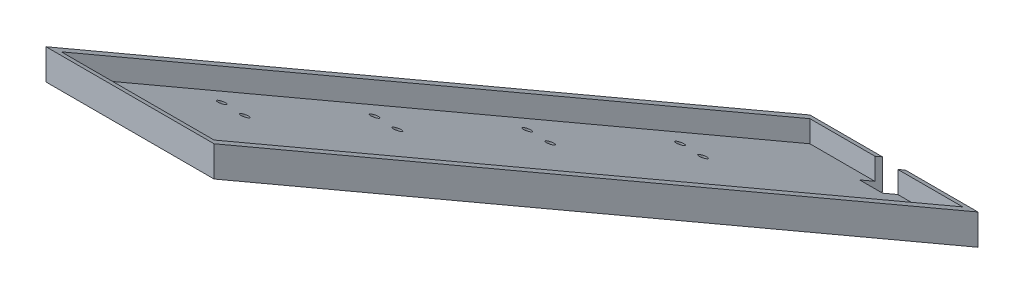
ISO-10303-21;
HEADER;
FILE_DESCRIPTION(('STEP AP214'),'2;1');
FILE_NAME('part.step','',(''),(''),'','','');
FILE_SCHEMA(('AUTOMOTIVE_DESIGN { 1 0 10303 214 1 1 1 1 }'));
ENDSEC;
DATA;
#1=APPLICATION_CONTEXT('core data for automotive mechanical design processes');
#2=APPLICATION_PROTOCOL_DEFINITION('international standard','automotive_design',2000,#1);
#3=PRODUCT_CONTEXT('',#1,'mechanical');
#4=PRODUCT('Part','Part','',(#3));
#5=PRODUCT_RELATED_PRODUCT_CATEGORY('part','',(#4));
#6=PRODUCT_DEFINITION_FORMATION('','',#4);
#7=PRODUCT_DEFINITION_CONTEXT('part definition',#1,'design');
#8=PRODUCT_DEFINITION('design','',#6,#7);
#9=PRODUCT_DEFINITION_SHAPE('','',#8);
#10=(LENGTH_UNIT() NAMED_UNIT(*) SI_UNIT(.MILLI.,.METRE.));
#11=(NAMED_UNIT(*) PLANE_ANGLE_UNIT() SI_UNIT($,.RADIAN.));
#12=(NAMED_UNIT(*) SI_UNIT($,.STERADIAN.) SOLID_ANGLE_UNIT());
#13=UNCERTAINTY_MEASURE_WITH_UNIT(LENGTH_MEASURE(1.E-05),#10,'distance_accuracy_value','');
#14=(GEOMETRIC_REPRESENTATION_CONTEXT(3) GLOBAL_UNCERTAINTY_ASSIGNED_CONTEXT((#13)) GLOBAL_UNIT_ASSIGNED_CONTEXT((#10,
#11,#12)) REPRESENTATION_CONTEXT('',''));
#15=CARTESIAN_POINT('',(0.,0.,0.));
#16=DIRECTION('',(0.,0.,1.));
#17=DIRECTION('',(1.,0.,0.));
#18=AXIS2_PLACEMENT_3D('',#15,#16,#17);
#19=CARTESIAN_POINT('',(110.,20.,0.));
#20=DIRECTION('',(0.,-0.866025403784442,0.499999999999994));
#21=DIRECTION('',(0.,-0.499999999999994,-0.866025403784442));
#22=AXIS2_PLACEMENT_3D('',#19,#20,#21);
#23=PLANE('',#22);
#24=DIRECTION('',(0.,-0.499999999999994,-0.866025403784442));
#25=VECTOR('',#24,1.);
#26=CARTESIAN_POINT('',(62.5,20.,0.));
#27=LINE('',#26,#25);
#28=CARTESIAN_POINT('',(62.5,22.8867513459483,4.99999999999995));
#29=VERTEX_POINT('',#28);
#30=CARTESIAN_POINT('',(62.5,20.,0.));
#31=VERTEX_POINT('',#30);
#32=EDGE_CURVE('E271',#29,#31,#27,.T.);
#33=ORIENTED_EDGE('',*,*,#32,.F.);
#34=DIRECTION('',(-1.,0.,0.));
#35=VECTOR('',#34,1.);
#36=CARTESIAN_POINT('',(105.,22.8867513459483,4.99999999999995));
#37=LINE('',#36,#35);
#38=CARTESIAN_POINT('',(105.,22.8867513459483,4.99999999999995));
#39=VERTEX_POINT('',#38);
#40=EDGE_CURVE('E302',#39,#29,#37,.T.);
#41=ORIENTED_EDGE('',*,*,#40,.F.);
#42=DIRECTION('',(0.,0.5,0.866025403784439));
#43=VECTOR('',#42,1.);
#44=CARTESIAN_POINT('',(105.,305.788383248865,495.));
#45=LINE('',#44,#43);
#46=CARTESIAN_POINT('',(105.,305.788383248865,495.));
#47=VERTEX_POINT('',#46);
#48=EDGE_CURVE('E288',#39,#47,#45,.T.);
#49=ORIENTED_EDGE('',*,*,#48,.T.);
#50=DIRECTION('',(-1.,0.,0.));
#51=VECTOR('',#50,1.);
#52=CARTESIAN_POINT('',(105.,305.788383248865,495.));
#53=LINE('',#52,#51);
#54=CARTESIAN_POINT('',(5.,305.788383248865,495.));
#55=VERTEX_POINT('',#54);
#56=EDGE_CURVE('E291',#47,#55,#53,.T.);
#57=ORIENTED_EDGE('',*,*,#56,.T.);
#58=DIRECTION('',(0.,0.5,0.866025403784439));
#59=VECTOR('',#58,1.);
#60=CARTESIAN_POINT('',(5.,305.788383248865,495.));
#61=LINE('',#60,#59);
#62=CARTESIAN_POINT('',(5.,22.8867513459481,4.99999999999995));
#63=VERTEX_POINT('',#62);
#64=EDGE_CURVE('E284',#63,#55,#61,.T.);
#65=ORIENTED_EDGE('',*,*,#64,.F.);
#66=CARTESIAN_POINT('',(47.5,22.8867513459483,4.99999999999995));
#67=VERTEX_POINT('',#66);
#68=EDGE_CURVE('E64',#67,#63,#37,.T.);
#69=ORIENTED_EDGE('',*,*,#68,.F.);
#70=DIRECTION('',(0.,0.499999999999994,0.866025403784442));
#71=VECTOR('',#70,1.);
#72=CARTESIAN_POINT('',(47.5,20.,0.));
#73=LINE('',#72,#71);
#74=CARTESIAN_POINT('',(47.5,20.,0.));
#75=VERTEX_POINT('',#74);
#76=EDGE_CURVE('E57',#75,#67,#73,.T.);
#77=ORIENTED_EDGE('',*,*,#76,.F.);
#78=DIRECTION('',(-1.,0.,0.));
#79=VECTOR('',#78,1.);
#80=CARTESIAN_POINT('',(110.,20.,0.));
#81=LINE('',#80,#79);
#82=CARTESIAN_POINT('',(0.,20.,0.));
#83=VERTEX_POINT('',#82);
#84=EDGE_CURVE('E160',#75,#83,#81,.T.);
#85=ORIENTED_EDGE('',*,*,#84,.T.);
#86=DIRECTION('',(0.,0.499999999999994,0.866025403784442));
#87=VECTOR('',#86,1.);
#88=CARTESIAN_POINT('',(0.,20.,0.));
#89=LINE('',#88,#87);
#90=CARTESIAN_POINT('',(0.,308.675134594809,500.));
#91=VERTEX_POINT('',#90);
#92=EDGE_CURVE('E320',#83,#91,#89,.T.);
#93=ORIENTED_EDGE('',*,*,#92,.T.);
#94=DIRECTION('',(-1.,0.,0.));
#95=VECTOR('',#94,1.);
#96=CARTESIAN_POINT('',(110.,308.675134594809,500.));
#97=LINE('',#96,#95);
#98=CARTESIAN_POINT('',(110.,308.675134594809,500.));
#99=VERTEX_POINT('',#98);
#100=EDGE_CURVE('E179',#99,#91,#97,.T.);
#101=ORIENTED_EDGE('',*,*,#100,.F.);
#102=DIRECTION('',(0.,0.499999999999994,0.866025403784442));
#103=VECTOR('',#102,1.);
#104=CARTESIAN_POINT('',(110.,20.,0.));
#105=LINE('',#104,#103);
#106=CARTESIAN_POINT('',(110.,20.,0.));
#107=VERTEX_POINT('',#106);
#108=EDGE_CURVE('E316',#107,#99,#105,.T.);
#109=ORIENTED_EDGE('',*,*,#108,.F.);
#110=EDGE_CURVE('E182',#107,#31,#81,.T.);
#111=ORIENTED_EDGE('',*,*,#110,.T.);
#112=EDGE_LOOP('',(#33,#41,#49,#57,#65,#69,#77,#85,#93,#101,#109,#111));
#113=FACE_BOUND('',#112,.T.);
#114=ADVANCED_FACE('F40',(#113),#23,.F.);
#115=CARTESIAN_POINT('',(110.,20.,0.));
#116=DIRECTION('',(0.,0.,1.));
#117=DIRECTION('',(1.,0.,0.));
#118=AXIS2_PLACEMENT_3D('',#115,#116,#117);
#119=PLANE('',#118);
#120=DIRECTION('',(0.,-1.,0.));
#121=VECTOR('',#120,1.);
#122=CARTESIAN_POINT('',(62.5,20.,0.));
#123=LINE('',#122,#121);
#124=CARTESIAN_POINT('',(62.5,0.,0.));
#125=VERTEX_POINT('',#124);
#126=EDGE_CURVE('E273',#31,#125,#123,.T.);
#127=ORIENTED_EDGE('',*,*,#126,.F.);
#128=ORIENTED_EDGE('',*,*,#110,.F.);
#129=DIRECTION('',(0.,1.,0.));
#130=VECTOR('',#129,1.);
#131=CARTESIAN_POINT('',(110.,20.,0.));
#132=LINE('',#131,#130);
#133=CARTESIAN_POINT('',(110.,0.,0.));
#134=VERTEX_POINT('',#133);
#135=EDGE_CURVE('E313',#134,#107,#132,.T.);
#136=ORIENTED_EDGE('',*,*,#135,.F.);
#137=DIRECTION('',(-1.,0.,0.));
#138=VECTOR('',#137,1.);
#139=CARTESIAN_POINT('',(110.,0.,0.));
#140=LINE('',#139,#138);
#141=EDGE_CURVE('E168',#134,#125,#140,.T.);
#142=ORIENTED_EDGE('',*,*,#141,.T.);
#143=EDGE_LOOP('',(#127,#128,#136,#142));
#144=FACE_BOUND('',#143,.T.);
#145=ADVANCED_FACE('F42',(#144),#119,.F.);
#146=DIRECTION('',(0.,1.,0.));
#147=VECTOR('',#146,1.);
#148=CARTESIAN_POINT('',(47.5,20.,0.));
#149=LINE('',#148,#147);
#150=CARTESIAN_POINT('',(47.5,0.,0.));
#151=VERTEX_POINT('',#150);
#152=EDGE_CURVE('E146',#151,#75,#149,.T.);
#153=ORIENTED_EDGE('',*,*,#152,.F.);
#154=CARTESIAN_POINT('',(0.,0.,0.));
#155=VERTEX_POINT('',#154);
#156=EDGE_CURVE('E158',#151,#155,#140,.T.);
#157=ORIENTED_EDGE('',*,*,#156,.T.);
#158=DIRECTION('',(0.,1.,0.));
#159=VECTOR('',#158,1.);
#160=CARTESIAN_POINT('',(0.,20.,0.));
#161=LINE('',#160,#159);
#162=EDGE_CURVE('E312',#155,#83,#161,.T.);
#163=ORIENTED_EDGE('',*,*,#162,.T.);
#164=ORIENTED_EDGE('',*,*,#84,.F.);
#165=EDGE_LOOP('',(#153,#157,#163,#164));
#166=FACE_BOUND('',#165,.T.);
#167=ADVANCED_FACE('F156',(#166),#119,.F.);
#168=CARTESIAN_POINT('',(110.,0.,0.));
#169=DIRECTION('',(0.,0.866025403784442,-0.499999999999994));
#170=DIRECTION('',(0.,0.499999999999994,0.866025403784442));
#171=AXIS2_PLACEMENT_3D('',#168,#169,#170);
#172=PLANE('',#171);
#173=CARTESIAN_POINT('',(35.,118.356805183872,205.));
#174=DIRECTION('',(0.,0.866025403784442,-0.499999999999994));
#175=DIRECTION('',(0.,-0.499999999999994,-0.866025403784442));
#176=AXIS2_PLACEMENT_3D('',#173,#174,#175);
#177=ELLIPSE('',#176,2.88675134594812,2.5);
#178=CARTESIAN_POINT('',(35.,116.913429510897,202.5));
#179=VERTEX_POINT('',#178);
#180=EDGE_CURVE('E258',#179,#179,#177,.F.);
#181=ORIENTED_EDGE('',*,*,#180,.F.);
#182=EDGE_LOOP('',(#181));
#183=FACE_BOUND('',#182,.T.);
#184=CARTESIAN_POINT('',(35.,176.091832102833,305.));
#185=DIRECTION('',(0.,0.866025403784442,-0.499999999999994));
#186=DIRECTION('',(0.,-0.499999999999994,-0.866025403784442));
#187=AXIS2_PLACEMENT_3D('',#184,#185,#186);
#188=ELLIPSE('',#187,2.88675134594811,2.5);
#189=CARTESIAN_POINT('',(35.,174.648456429859,302.5));
#190=VERTEX_POINT('',#189);
#191=EDGE_CURVE('E246',#190,#190,#188,.F.);
#192=ORIENTED_EDGE('',*,*,#191,.F.);
#193=EDGE_LOOP('',(#192));
#194=FACE_BOUND('',#193,.T.);
#195=CARTESIAN_POINT('',(35.0000000000001,233.826859021795,405.));
#196=DIRECTION('',(0.,0.866025403784442,-0.499999999999994));
#197=DIRECTION('',(0.,-0.499999999999994,-0.866025403784442));
#198=AXIS2_PLACEMENT_3D('',#195,#196,#197);
#199=ELLIPSE('',#198,2.88675134594811,2.5);
#200=CARTESIAN_POINT('',(35.0000000000001,232.383483348821,402.5));
#201=VERTEX_POINT('',#200);
#202=EDGE_CURVE('E243',#201,#201,#199,.F.);
#203=ORIENTED_EDGE('',*,*,#202,.F.);
#204=EDGE_LOOP('',(#203));
#205=FACE_BOUND('',#204,.T.);
#206=CARTESIAN_POINT('',(35.,60.6217782649097,105.));
#207=DIRECTION('',(0.,0.866025403784442,-0.499999999999994));
#208=DIRECTION('',(0.,-0.499999999999994,-0.866025403784442));
#209=AXIS2_PLACEMENT_3D('',#206,#207,#208);
#210=ELLIPSE('',#209,2.88675134594812,2.5);
#211=CARTESIAN_POINT('',(35.,59.1784025919357,102.5));
#212=VERTEX_POINT('',#211);
#213=EDGE_CURVE('E240',#212,#212,#210,.F.);
#214=ORIENTED_EDGE('',*,*,#213,.F.);
#215=EDGE_LOOP('',(#214));
#216=FACE_BOUND('',#215,.T.);
#217=CARTESIAN_POINT('',(20.0000000000001,233.826859021795,405.));
#218=DIRECTION('',(0.,0.866025403784442,-0.499999999999994));
#219=DIRECTION('',(0.,-0.499999999999994,-0.866025403784442));
#220=AXIS2_PLACEMENT_3D('',#217,#218,#219);
#221=ELLIPSE('',#220,2.88675134594812,2.5);
#222=CARTESIAN_POINT('',(20.0000000000001,232.383483348821,402.5));
#223=VERTEX_POINT('',#222);
#224=EDGE_CURVE('E236',#223,#223,#221,.F.);
#225=ORIENTED_EDGE('',*,*,#224,.F.);
#226=EDGE_LOOP('',(#225));
#227=FACE_BOUND('',#226,.T.);
#228=CARTESIAN_POINT('',(20.,176.091832102833,305.));
#229=DIRECTION('',(0.,0.866025403784442,-0.499999999999994));
#230=DIRECTION('',(0.,-0.499999999999994,-0.866025403784442));
#231=AXIS2_PLACEMENT_3D('',#228,#229,#230);
#232=ELLIPSE('',#231,2.88675134594812,2.5);
#233=CARTESIAN_POINT('',(20.,174.648456429859,302.5));
#234=VERTEX_POINT('',#233);
#235=EDGE_CURVE('E232',#234,#234,#232,.F.);
#236=ORIENTED_EDGE('',*,*,#235,.F.);
#237=EDGE_LOOP('',(#236));
#238=FACE_BOUND('',#237,.T.);
#239=CARTESIAN_POINT('',(20.,118.356805183872,205.));
#240=DIRECTION('',(0.,0.866025403784442,-0.499999999999994));
#241=DIRECTION('',(0.,-0.499999999999994,-0.866025403784442));
#242=AXIS2_PLACEMENT_3D('',#239,#240,#241);
#243=ELLIPSE('',#242,2.88675134594812,2.5);
#244=CARTESIAN_POINT('',(20.,116.913429510897,202.5));
#245=VERTEX_POINT('',#244);
#246=EDGE_CURVE('E228',#245,#245,#243,.F.);
#247=ORIENTED_EDGE('',*,*,#246,.F.);
#248=EDGE_LOOP('',(#247));
#249=FACE_BOUND('',#248,.T.);
#250=CARTESIAN_POINT('',(90.,60.6217782649097,105.));
#251=DIRECTION('',(0.,0.866025403784442,-0.499999999999994));
#252=DIRECTION('',(0.,-0.499999999999994,-0.866025403784442));
#253=AXIS2_PLACEMENT_3D('',#250,#251,#252);
#254=ELLIPSE('',#253,2.88675134594813,2.50000000000001);
#255=CARTESIAN_POINT('',(90.,59.1784025919357,102.5));
#256=VERTEX_POINT('',#255);
#257=EDGE_CURVE('E224',#256,#256,#254,.F.);
#258=ORIENTED_EDGE('',*,*,#257,.F.);
#259=EDGE_LOOP('',(#258));
#260=FACE_BOUND('',#259,.T.);
#261=CARTESIAN_POINT('',(75.,60.6217782649097,105.));
#262=DIRECTION('',(0.,0.866025403784442,-0.499999999999994));
#263=DIRECTION('',(0.,-0.499999999999994,-0.866025403784442));
#264=AXIS2_PLACEMENT_3D('',#261,#262,#263);
#265=ELLIPSE('',#264,2.88675134594813,2.50000000000001);
#266=CARTESIAN_POINT('',(75.,59.1784025919357,102.5));
#267=VERTEX_POINT('',#266);
#268=EDGE_CURVE('E220',#267,#267,#265,.F.);
#269=ORIENTED_EDGE('',*,*,#268,.F.);
#270=EDGE_LOOP('',(#269));
#271=FACE_BOUND('',#270,.T.);
#272=CARTESIAN_POINT('',(75.0000000000001,233.826859021795,405.));
#273=DIRECTION('',(0.,0.866025403784442,-0.499999999999994));
#274=DIRECTION('',(0.,-0.499999999999994,-0.866025403784442));
#275=AXIS2_PLACEMENT_3D('',#272,#273,#274);
#276=ELLIPSE('',#275,2.88675134594813,2.50000000000001);
#277=CARTESIAN_POINT('',(75.0000000000001,232.383483348821,402.5));
#278=VERTEX_POINT('',#277);
#279=EDGE_CURVE('E216',#278,#278,#276,.F.);
#280=ORIENTED_EDGE('',*,*,#279,.F.);
#281=EDGE_LOOP('',(#280));
#282=FACE_BOUND('',#281,.T.);
#283=CARTESIAN_POINT('',(75.0000000000001,176.091832102833,305.));
#284=DIRECTION('',(0.,0.866025403784442,-0.499999999999994));
#285=DIRECTION('',(0.,-0.499999999999994,-0.866025403784442));
#286=AXIS2_PLACEMENT_3D('',#283,#284,#285);
#287=ELLIPSE('',#286,2.88675134594813,2.50000000000001);
#288=CARTESIAN_POINT('',(75.0000000000001,174.648456429859,302.5));
#289=VERTEX_POINT('',#288);
#290=EDGE_CURVE('E212',#289,#289,#287,.F.);
#291=ORIENTED_EDGE('',*,*,#290,.F.);
#292=EDGE_LOOP('',(#291));
#293=FACE_BOUND('',#292,.T.);
#294=CARTESIAN_POINT('',(90.0000000000001,118.356805183872,205.));
#295=DIRECTION('',(0.,0.866025403784442,-0.499999999999994));
#296=DIRECTION('',(0.,-0.499999999999994,-0.866025403784442));
#297=AXIS2_PLACEMENT_3D('',#294,#295,#296);
#298=ELLIPSE('',#297,2.88675134594813,2.50000000000001);
#299=CARTESIAN_POINT('',(90.0000000000001,116.913429510897,202.5));
#300=VERTEX_POINT('',#299);
#301=EDGE_CURVE('E208',#300,#300,#298,.F.);
#302=ORIENTED_EDGE('',*,*,#301,.F.);
#303=EDGE_LOOP('',(#302));
#304=FACE_BOUND('',#303,.T.);
#305=CARTESIAN_POINT('',(90.0000000000001,176.091832102833,305.));
#306=DIRECTION('',(0.,0.866025403784442,-0.499999999999994));
#307=DIRECTION('',(0.,-0.499999999999994,-0.866025403784442));
#308=AXIS2_PLACEMENT_3D('',#305,#306,#307);
#309=ELLIPSE('',#308,2.88675134594813,2.50000000000001);
#310=CARTESIAN_POINT('',(90.0000000000001,174.648456429859,302.5));
#311=VERTEX_POINT('',#310);
#312=EDGE_CURVE('E204',#311,#311,#309,.F.);
#313=ORIENTED_EDGE('',*,*,#312,.F.);
#314=EDGE_LOOP('',(#313));
#315=FACE_BOUND('',#314,.T.);
#316=CARTESIAN_POINT('',(90.0000000000001,233.826859021795,405.));
#317=DIRECTION('',(0.,0.866025403784442,-0.499999999999994));
#318=DIRECTION('',(0.,-0.499999999999994,-0.866025403784442));
#319=AXIS2_PLACEMENT_3D('',#316,#317,#318);
#320=ELLIPSE('',#319,2.88675134594813,2.50000000000001);
#321=CARTESIAN_POINT('',(90.0000000000001,232.383483348821,402.5));
#322=VERTEX_POINT('',#321);
#323=EDGE_CURVE('E200',#322,#322,#320,.F.);
#324=ORIENTED_EDGE('',*,*,#323,.F.);
#325=EDGE_LOOP('',(#324));
#326=FACE_BOUND('',#325,.T.);
#327=CARTESIAN_POINT('',(75.0000000000001,118.356805183872,205.));
#328=DIRECTION('',(0.,0.866025403784442,-0.499999999999994));
#329=DIRECTION('',(0.,-0.499999999999994,-0.866025403784442));
#330=AXIS2_PLACEMENT_3D('',#327,#328,#329);
#331=ELLIPSE('',#330,2.88675134594813,2.50000000000001);
#332=CARTESIAN_POINT('',(75.0000000000001,116.913429510897,202.5));
#333=VERTEX_POINT('',#332);
#334=EDGE_CURVE('E196',#333,#333,#331,.F.);
#335=ORIENTED_EDGE('',*,*,#334,.F.);
#336=EDGE_LOOP('',(#335));
#337=FACE_BOUND('',#336,.T.);
#338=CARTESIAN_POINT('',(20.,60.6217782649097,105.));
#339=DIRECTION('',(0.,0.866025403784442,-0.499999999999994));
#340=DIRECTION('',(0.,-0.499999999999994,-0.866025403784442));
#341=AXIS2_PLACEMENT_3D('',#338,#339,#340);
#342=ELLIPSE('',#341,2.88675134594812,2.5);
#343=CARTESIAN_POINT('',(20.,59.1784025919357,102.5));
#344=VERTEX_POINT('',#343);
#345=EDGE_CURVE('E192',#344,#344,#342,.F.);
#346=ORIENTED_EDGE('',*,*,#345,.F.);
#347=EDGE_LOOP('',(#346));
#348=FACE_BOUND('',#347,.T.);
#349=DIRECTION('',(0.,0.499999999999994,0.866025403784442));
#350=VECTOR('',#349,1.);
#351=CARTESIAN_POINT('',(62.5,0.,0.));
#352=LINE('',#351,#350);
#353=CARTESIAN_POINT('',(62.5,8.66025403784429,15.));
#354=VERTEX_POINT('',#353);
#355=EDGE_CURVE('E275',#125,#354,#352,.T.);
#356=ORIENTED_EDGE('',*,*,#355,.F.);
#357=ORIENTED_EDGE('',*,*,#141,.F.);
#358=DIRECTION('',(0.,-0.499999999999994,-0.866025403784442));
#359=VECTOR('',#358,1.);
#360=CARTESIAN_POINT('',(110.,0.,0.));
#361=LINE('',#360,#359);
#362=CARTESIAN_POINT('',(110.,288.675134594809,500.));
#363=VERTEX_POINT('',#362);
#364=EDGE_CURVE('E169',#363,#134,#361,.T.);
#365=ORIENTED_EDGE('',*,*,#364,.F.);
#366=DIRECTION('',(-1.,0.,0.));
#367=VECTOR('',#366,1.);
#368=CARTESIAN_POINT('',(110.,288.675134594809,500.));
#369=LINE('',#368,#367);
#370=CARTESIAN_POINT('',(0.,288.675134594809,500.));
#371=VERTEX_POINT('',#370);
#372=EDGE_CURVE('E172',#363,#371,#369,.T.);
#373=ORIENTED_EDGE('',*,*,#372,.T.);
#374=DIRECTION('',(0.,-0.499999999999994,-0.866025403784442));
#375=VECTOR('',#374,1.);
#376=CARTESIAN_POINT('',(0.,0.,0.));
#377=LINE('',#376,#375);
#378=EDGE_CURVE('E166',#371,#155,#377,.T.);
#379=ORIENTED_EDGE('',*,*,#378,.T.);
#380=ORIENTED_EDGE('',*,*,#156,.F.);
#381=DIRECTION('',(0.,-0.499999999999994,-0.866025403784442));
#382=VECTOR('',#381,1.);
#383=CARTESIAN_POINT('',(47.5,0.,0.));
#384=LINE('',#383,#382);
#385=CARTESIAN_POINT('',(47.5,8.66025403784429,15.));
#386=VERTEX_POINT('',#385);
#387=EDGE_CURVE('E143',#386,#151,#384,.T.);
#388=ORIENTED_EDGE('',*,*,#387,.F.);
#389=DIRECTION('',(-1.,0.,0.));
#390=VECTOR('',#389,1.);
#391=CARTESIAN_POINT('',(110.,8.66025403784426,15.));
#392=LINE('',#391,#390);
#393=EDGE_CURVE('E277',#354,#386,#392,.T.);
#394=ORIENTED_EDGE('',*,*,#393,.F.);
#395=EDGE_LOOP('',(#356,#357,#365,#373,#379,#380,#388,#394));
#396=FACE_BOUND('',#395,.T.);
#397=ADVANCED_FACE('F163',(#183,#194,#205,#216,#227,#238,#249,#260,#271,#282,#293,#304,#315,
#326,#337,#348,#396),#172,.F.);
#398=CARTESIAN_POINT('',(105.,291.561885940757,495.));
#399=DIRECTION('',(0.,0.866025403784439,-0.5));
#400=DIRECTION('',(0.,0.5,0.866025403784439));
#401=AXIS2_PLACEMENT_3D('',#398,#399,#400);
#402=PLANE('',#401);
#403=CARTESIAN_POINT('',(35.,124.130307875765,205.));
#404=DIRECTION('',(0.,0.866025403784439,-0.5));
#405=DIRECTION('',(0.,-0.5,-0.866025403784439));
#406=AXIS2_PLACEMENT_3D('',#403,#404,#405);
#407=ELLIPSE('',#406,2.88675134594813,2.5);
#408=CARTESIAN_POINT('',(35.,122.686932202791,202.5));
#409=VERTEX_POINT('',#408);
#410=EDGE_CURVE('E44',#409,#409,#407,.F.);
#411=ORIENTED_EDGE('',*,*,#410,.T.);
#412=EDGE_LOOP('',(#411));
#413=FACE_BOUND('',#412,.T.);
#414=CARTESIAN_POINT('',(35.,181.865334794728,305.));
#415=DIRECTION('',(0.,0.866025403784439,-0.5));
#416=DIRECTION('',(0.,-0.5,-0.866025403784439));
#417=AXIS2_PLACEMENT_3D('',#414,#415,#416);
#418=ELLIPSE('',#417,2.88675134594812,2.5);
#419=CARTESIAN_POINT('',(35.,180.421959121754,302.5));
#420=VERTEX_POINT('',#419);
#421=EDGE_CURVE('E244',#420,#420,#418,.F.);
#422=ORIENTED_EDGE('',*,*,#421,.T.);
#423=EDGE_LOOP('',(#422));
#424=FACE_BOUND('',#423,.T.);
#425=CARTESIAN_POINT('',(35.0000000000001,239.60036171369,405.));
#426=DIRECTION('',(0.,0.866025403784439,-0.5));
#427=DIRECTION('',(0.,-0.5,-0.866025403784439));
#428=AXIS2_PLACEMENT_3D('',#425,#426,#427);
#429=ELLIPSE('',#428,2.88675134594812,2.5);
#430=CARTESIAN_POINT('',(35.0000000000001,238.156986040716,402.5));
#431=VERTEX_POINT('',#430);
#432=EDGE_CURVE('E241',#431,#431,#429,.F.);
#433=ORIENTED_EDGE('',*,*,#432,.T.);
#434=EDGE_LOOP('',(#433));
#435=FACE_BOUND('',#434,.T.);
#436=CARTESIAN_POINT('',(35.,66.3952809568025,105.));
#437=DIRECTION('',(0.,0.866025403784439,-0.5));
#438=DIRECTION('',(0.,-0.5,-0.866025403784439));
#439=AXIS2_PLACEMENT_3D('',#436,#437,#438);
#440=ELLIPSE('',#439,2.88675134594813,2.5);
#441=CARTESIAN_POINT('',(35.,64.9519052838285,102.5));
#442=VERTEX_POINT('',#441);
#443=EDGE_CURVE('E237',#442,#442,#440,.F.);
#444=ORIENTED_EDGE('',*,*,#443,.T.);
#445=EDGE_LOOP('',(#444));
#446=FACE_BOUND('',#445,.T.);
#447=CARTESIAN_POINT('',(20.0000000000001,239.60036171369,405.));
#448=DIRECTION('',(0.,0.866025403784439,-0.5));
#449=DIRECTION('',(0.,-0.5,-0.866025403784439));
#450=AXIS2_PLACEMENT_3D('',#447,#448,#449);
#451=ELLIPSE('',#450,2.88675134594813,2.5);
#452=CARTESIAN_POINT('',(20.0000000000001,238.156986040716,402.5));
#453=VERTEX_POINT('',#452);
#454=EDGE_CURVE('E233',#453,#453,#451,.F.);
#455=ORIENTED_EDGE('',*,*,#454,.T.);
#456=EDGE_LOOP('',(#455));
#457=FACE_BOUND('',#456,.T.);
#458=CARTESIAN_POINT('',(20.,181.865334794728,305.));
#459=DIRECTION('',(0.,0.866025403784439,-0.5));
#460=DIRECTION('',(0.,-0.5,-0.866025403784439));
#461=AXIS2_PLACEMENT_3D('',#458,#459,#460);
#462=ELLIPSE('',#461,2.88675134594813,2.5);
#463=CARTESIAN_POINT('',(20.,180.421959121754,302.5));
#464=VERTEX_POINT('',#463);
#465=EDGE_CURVE('E229',#464,#464,#462,.F.);
#466=ORIENTED_EDGE('',*,*,#465,.T.);
#467=EDGE_LOOP('',(#466));
#468=FACE_BOUND('',#467,.T.);
#469=CARTESIAN_POINT('',(20.,124.130307875765,205.));
#470=DIRECTION('',(0.,0.866025403784439,-0.5));
#471=DIRECTION('',(0.,-0.5,-0.866025403784439));
#472=AXIS2_PLACEMENT_3D('',#469,#470,#471);
#473=ELLIPSE('',#472,2.88675134594813,2.5);
#474=CARTESIAN_POINT('',(20.,122.686932202791,202.5));
#475=VERTEX_POINT('',#474);
#476=EDGE_CURVE('E225',#475,#475,#473,.F.);
#477=ORIENTED_EDGE('',*,*,#476,.T.);
#478=EDGE_LOOP('',(#477));
#479=FACE_BOUND('',#478,.T.);
#480=CARTESIAN_POINT('',(90.,66.3952809568025,105.));
#481=DIRECTION('',(0.,0.866025403784439,-0.5));
#482=DIRECTION('',(0.,-0.5,-0.866025403784439));
#483=AXIS2_PLACEMENT_3D('',#480,#481,#482);
#484=ELLIPSE('',#483,2.88675134594814,2.50000000000001);
#485=CARTESIAN_POINT('',(90.,64.9519052838285,102.5));
#486=VERTEX_POINT('',#485);
#487=EDGE_CURVE('E221',#486,#486,#484,.F.);
#488=ORIENTED_EDGE('',*,*,#487,.T.);
#489=EDGE_LOOP('',(#488));
#490=FACE_BOUND('',#489,.T.);
#491=CARTESIAN_POINT('',(75.,66.3952809568025,105.));
#492=DIRECTION('',(0.,0.866025403784439,-0.5));
#493=DIRECTION('',(0.,-0.5,-0.866025403784439));
#494=AXIS2_PLACEMENT_3D('',#491,#492,#493);
#495=ELLIPSE('',#494,2.88675134594814,2.50000000000001);
#496=CARTESIAN_POINT('',(75.,64.9519052838285,102.5));
#497=VERTEX_POINT('',#496);
#498=EDGE_CURVE('E217',#497,#497,#495,.F.);
#499=ORIENTED_EDGE('',*,*,#498,.T.);
#500=EDGE_LOOP('',(#499));
#501=FACE_BOUND('',#500,.T.);
#502=CARTESIAN_POINT('',(75.0000000000001,239.60036171369,405.));
#503=DIRECTION('',(0.,0.866025403784439,-0.5));
#504=DIRECTION('',(0.,-0.5,-0.866025403784439));
#505=AXIS2_PLACEMENT_3D('',#502,#503,#504);
#506=ELLIPSE('',#505,2.88675134594814,2.50000000000001);
#507=CARTESIAN_POINT('',(75.0000000000001,238.156986040716,402.5));
#508=VERTEX_POINT('',#507);
#509=EDGE_CURVE('E213',#508,#508,#506,.F.);
#510=ORIENTED_EDGE('',*,*,#509,.T.);
#511=EDGE_LOOP('',(#510));
#512=FACE_BOUND('',#511,.T.);
#513=CARTESIAN_POINT('',(75.0000000000001,181.865334794728,305.));
#514=DIRECTION('',(0.,0.866025403784439,-0.5));
#515=DIRECTION('',(0.,-0.5,-0.866025403784439));
#516=AXIS2_PLACEMENT_3D('',#513,#514,#515);
#517=ELLIPSE('',#516,2.88675134594814,2.50000000000001);
#518=CARTESIAN_POINT('',(75.0000000000001,180.421959121754,302.5));
#519=VERTEX_POINT('',#518);
#520=EDGE_CURVE('E209',#519,#519,#517,.F.);
#521=ORIENTED_EDGE('',*,*,#520,.T.);
#522=EDGE_LOOP('',(#521));
#523=FACE_BOUND('',#522,.T.);
#524=CARTESIAN_POINT('',(90.0000000000001,124.130307875765,205.));
#525=DIRECTION('',(0.,0.866025403784439,-0.5));
#526=DIRECTION('',(0.,-0.5,-0.866025403784439));
#527=AXIS2_PLACEMENT_3D('',#524,#525,#526);
#528=ELLIPSE('',#527,2.88675134594814,2.50000000000001);
#529=CARTESIAN_POINT('',(90.0000000000001,122.686932202791,202.5));
#530=VERTEX_POINT('',#529);
#531=EDGE_CURVE('E205',#530,#530,#528,.F.);
#532=ORIENTED_EDGE('',*,*,#531,.T.);
#533=EDGE_LOOP('',(#532));
#534=FACE_BOUND('',#533,.T.);
#535=CARTESIAN_POINT('',(90.0000000000001,181.865334794728,305.));
#536=DIRECTION('',(0.,0.866025403784439,-0.5));
#537=DIRECTION('',(0.,-0.5,-0.866025403784439));
#538=AXIS2_PLACEMENT_3D('',#535,#536,#537);
#539=ELLIPSE('',#538,2.88675134594814,2.50000000000001);
#540=CARTESIAN_POINT('',(90.0000000000001,180.421959121754,302.5));
#541=VERTEX_POINT('',#540);
#542=EDGE_CURVE('E201',#541,#541,#539,.F.);
#543=ORIENTED_EDGE('',*,*,#542,.T.);
#544=EDGE_LOOP('',(#543));
#545=FACE_BOUND('',#544,.T.);
#546=CARTESIAN_POINT('',(90.0000000000001,239.60036171369,405.));
#547=DIRECTION('',(0.,0.866025403784439,-0.5));
#548=DIRECTION('',(0.,-0.5,-0.866025403784439));
#549=AXIS2_PLACEMENT_3D('',#546,#547,#548);
#550=ELLIPSE('',#549,2.88675134594814,2.50000000000001);
#551=CARTESIAN_POINT('',(90.0000000000001,238.156986040716,402.5));
#552=VERTEX_POINT('',#551);
#553=EDGE_CURVE('E197',#552,#552,#550,.F.);
#554=ORIENTED_EDGE('',*,*,#553,.T.);
#555=EDGE_LOOP('',(#554));
#556=FACE_BOUND('',#555,.T.);
#557=CARTESIAN_POINT('',(75.0000000000001,124.130307875765,205.));
#558=DIRECTION('',(0.,0.866025403784439,-0.5));
#559=DIRECTION('',(0.,-0.5,-0.866025403784439));
#560=AXIS2_PLACEMENT_3D('',#557,#558,#559);
#561=ELLIPSE('',#560,2.88675134594814,2.50000000000001);
#562=CARTESIAN_POINT('',(75.0000000000001,122.686932202791,202.5));
#563=VERTEX_POINT('',#562);
#564=EDGE_CURVE('E193',#563,#563,#561,.F.);
#565=ORIENTED_EDGE('',*,*,#564,.T.);
#566=EDGE_LOOP('',(#565));
#567=FACE_BOUND('',#566,.T.);
#568=CARTESIAN_POINT('',(20.,66.3952809568025,105.));
#569=DIRECTION('',(0.,0.866025403784439,-0.5));
#570=DIRECTION('',(0.,-0.5,-0.866025403784439));
#571=AXIS2_PLACEMENT_3D('',#568,#569,#570);
#572=ELLIPSE('',#571,2.88675134594813,2.5);
#573=CARTESIAN_POINT('',(20.,64.9519052838285,102.5));
#574=VERTEX_POINT('',#573);
#575=EDGE_CURVE('E189',#574,#574,#572,.F.);
#576=ORIENTED_EDGE('',*,*,#575,.T.);
#577=EDGE_LOOP('',(#576));
#578=FACE_BOUND('',#577,.T.);
#579=DIRECTION('',(-1.,0.,0.));
#580=VECTOR('',#579,1.);
#581=CARTESIAN_POINT('',(105.,8.66025403783999,5.));
#582=LINE('',#581,#580);
#583=CARTESIAN_POINT('',(105.,8.66025403783999,5.));
#584=VERTEX_POINT('',#583);
#585=CARTESIAN_POINT('',(62.5,8.66025403783999,5.));
#586=VERTEX_POINT('',#585);
#587=EDGE_CURVE('E306',#584,#586,#582,.T.);
#588=ORIENTED_EDGE('',*,*,#587,.T.);
#589=DIRECTION('',(0.,0.5,0.866025403784439));
#590=VECTOR('',#589,1.);
#591=CARTESIAN_POINT('',(62.5000000000001,291.561885940757,495.));
#592=LINE('',#591,#590);
#593=CARTESIAN_POINT('',(62.5,14.4337567297363,15.));
#594=VERTEX_POINT('',#593);
#595=EDGE_CURVE('E152',#586,#594,#592,.T.);
#596=ORIENTED_EDGE('',*,*,#595,.T.);
#597=DIRECTION('',(-1.,0.,0.));
#598=VECTOR('',#597,1.);
#599=CARTESIAN_POINT('',(105.,14.4337567297362,15.));
#600=LINE('',#599,#598);
#601=CARTESIAN_POINT('',(47.5,14.4337567297363,15.));
#602=VERTEX_POINT('',#601);
#603=EDGE_CURVE('E11',#594,#602,#600,.T.);
#604=ORIENTED_EDGE('',*,*,#603,.T.);
#605=DIRECTION('',(0.,-0.5,-0.866025403784439));
#606=VECTOR('',#605,1.);
#607=CARTESIAN_POINT('',(47.5000000000001,291.561885940757,495.));
#608=LINE('',#607,#606);
#609=CARTESIAN_POINT('',(47.5,8.66025403783999,5.));
#610=VERTEX_POINT('',#609);
#611=EDGE_CURVE('E265',#602,#610,#608,.T.);
#612=ORIENTED_EDGE('',*,*,#611,.T.);
#613=CARTESIAN_POINT('',(5.,8.66025403783999,5.));
#614=VERTEX_POINT('',#613);
#615=EDGE_CURVE('E305',#610,#614,#582,.T.);
#616=ORIENTED_EDGE('',*,*,#615,.T.);
#617=DIRECTION('',(0.,-0.5,-0.866025403784439));
#618=VECTOR('',#617,1.);
#619=CARTESIAN_POINT('',(5.,291.561885940757,495.));
#620=LINE('',#619,#618);
#621=CARTESIAN_POINT('',(5.,291.561885940757,495.));
#622=VERTEX_POINT('',#621);
#623=EDGE_CURVE('E294',#622,#614,#620,.T.);
#624=ORIENTED_EDGE('',*,*,#623,.F.);
#625=DIRECTION('',(-1.,0.,0.));
#626=VECTOR('',#625,1.);
#627=CARTESIAN_POINT('',(105.,291.561885940757,495.));
#628=LINE('',#627,#626);
#629=CARTESIAN_POINT('',(105.,291.561885940757,495.));
#630=VERTEX_POINT('',#629);
#631=EDGE_CURVE('E309',#630,#622,#628,.T.);
#632=ORIENTED_EDGE('',*,*,#631,.F.);
#633=DIRECTION('',(0.,-0.5,-0.866025403784439));
#634=VECTOR('',#633,1.);
#635=CARTESIAN_POINT('',(105.,291.561885940757,495.));
#636=LINE('',#635,#634);
#637=EDGE_CURVE('E283',#630,#584,#636,.T.);
#638=ORIENTED_EDGE('',*,*,#637,.T.);
#639=EDGE_LOOP('',(#588,#596,#604,#612,#616,#624,#632,#638));
#640=FACE_BOUND('',#639,.T.);
#641=ADVANCED_FACE('F344',(#413,#424,#435,#446,#457,#468,#479,#490,#501,#512,#523,#534,#545,
#556,#567,#578,#640),#402,.T.);
#642=CARTESIAN_POINT('',(105.,8.66025403783999,5.));
#643=DIRECTION('',(0.,0.,1.));
#644=DIRECTION('',(0.,-1.,0.));
#645=AXIS2_PLACEMENT_3D('',#642,#643,#644);
#646=PLANE('',#645);
#647=ORIENTED_EDGE('',*,*,#40,.T.);
#648=DIRECTION('',(0.,-1.,0.));
#649=VECTOR('',#648,1.);
#650=CARTESIAN_POINT('',(62.5,8.66025403783999,5.));
#651=LINE('',#650,#649);
#652=EDGE_CURVE('E49',#29,#586,#651,.T.);
#653=ORIENTED_EDGE('',*,*,#652,.T.);
#654=ORIENTED_EDGE('',*,*,#587,.F.);
#655=DIRECTION('',(0.,1.,0.));
#656=VECTOR('',#655,1.);
#657=CARTESIAN_POINT('',(105.,8.66025403783999,5.));
#658=LINE('',#657,#656);
#659=EDGE_CURVE('E286',#584,#39,#658,.T.);
#660=ORIENTED_EDGE('',*,*,#659,.T.);
#661=EDGE_LOOP('',(#647,#653,#654,#660));
#662=FACE_BOUND('',#661,.T.);
#663=ADVANCED_FACE('F361',(#662),#646,.T.);
#664=ORIENTED_EDGE('',*,*,#615,.F.);
#665=DIRECTION('',(0.,1.,0.));
#666=VECTOR('',#665,1.);
#667=CARTESIAN_POINT('',(47.5,8.66025403783999,5.));
#668=LINE('',#667,#666);
#669=EDGE_CURVE('E185',#610,#67,#668,.T.);
#670=ORIENTED_EDGE('',*,*,#669,.T.);
#671=ORIENTED_EDGE('',*,*,#68,.T.);
#672=DIRECTION('',(0.,1.,0.));
#673=VECTOR('',#672,1.);
#674=CARTESIAN_POINT('',(5.,8.66025403783999,5.));
#675=LINE('',#674,#673);
#676=EDGE_CURVE('E297',#614,#63,#675,.T.);
#677=ORIENTED_EDGE('',*,*,#676,.F.);
#678=EDGE_LOOP('',(#664,#670,#671,#677));
#679=FACE_BOUND('',#678,.T.);
#680=ADVANCED_FACE('F347',(#679),#646,.T.);
#681=CARTESIAN_POINT('',(110.,288.675134594809,500.));
#682=DIRECTION('',(0.,0.,-1.));
#683=DIRECTION('',(-1.,0.,0.));
#684=AXIS2_PLACEMENT_3D('',#681,#682,#683);
#685=PLANE('',#684);
#686=DIRECTION('',(0.,-1.,0.));
#687=VECTOR('',#686,1.);
#688=CARTESIAN_POINT('',(0.,288.675134594809,500.));
#689=LINE('',#688,#687);
#690=EDGE_CURVE('E321',#91,#371,#689,.T.);
#691=ORIENTED_EDGE('',*,*,#690,.T.);
#692=ORIENTED_EDGE('',*,*,#372,.F.);
#693=DIRECTION('',(0.,-1.,0.));
#694=VECTOR('',#693,1.);
#695=CARTESIAN_POINT('',(110.,288.675134594809,500.));
#696=LINE('',#695,#694);
#697=EDGE_CURVE('E173',#99,#363,#696,.T.);
#698=ORIENTED_EDGE('',*,*,#697,.F.);
#699=ORIENTED_EDGE('',*,*,#100,.T.);
#700=EDGE_LOOP('',(#691,#692,#698,#699));
#701=FACE_BOUND('',#700,.T.);
#702=ADVANCED_FACE('F325',(#701),#685,.F.);
#703=CARTESIAN_POINT('',(110.,0.,0.));
#704=DIRECTION('',(-1.,0.,0.));
#705=DIRECTION('',(0.,0.,1.));
#706=AXIS2_PLACEMENT_3D('',#703,#704,#705);
#707=PLANE('',#706);
#708=ORIENTED_EDGE('',*,*,#135,.T.);
#709=ORIENTED_EDGE('',*,*,#108,.T.);
#710=ORIENTED_EDGE('',*,*,#697,.T.);
#711=ORIENTED_EDGE('',*,*,#364,.T.);
#712=EDGE_LOOP('',(#708,#709,#710,#711));
#713=FACE_BOUND('',#712,.T.);
#714=ADVANCED_FACE('F358',(#713),#707,.F.);
#715=CARTESIAN_POINT('',(0.,0.,0.));
#716=DIRECTION('',(-1.,0.,0.));
#717=DIRECTION('',(0.,0.,1.));
#718=AXIS2_PLACEMENT_3D('',#715,#716,#717);
#719=PLANE('',#718);
#720=ORIENTED_EDGE('',*,*,#162,.F.);
#721=ORIENTED_EDGE('',*,*,#378,.F.);
#722=ORIENTED_EDGE('',*,*,#690,.F.);
#723=ORIENTED_EDGE('',*,*,#92,.F.);
#724=EDGE_LOOP('',(#720,#721,#722,#723));
#725=FACE_BOUND('',#724,.T.);
#726=ADVANCED_FACE('F332',(#725),#719,.T.);
#727=CARTESIAN_POINT('',(105.,291.561885940757,495.));
#728=DIRECTION('',(0.,0.,-1.));
#729=DIRECTION('',(-1.,0.,0.));
#730=AXIS2_PLACEMENT_3D('',#727,#728,#729);
#731=PLANE('',#730);
#732=DIRECTION('',(0.,-1.,0.));
#733=VECTOR('',#732,1.);
#734=CARTESIAN_POINT('',(5.,291.561885940757,495.));
#735=LINE('',#734,#733);
#736=EDGE_CURVE('E279',#55,#622,#735,.T.);
#737=ORIENTED_EDGE('',*,*,#736,.F.);
#738=ORIENTED_EDGE('',*,*,#56,.F.);
#739=DIRECTION('',(0.,-1.,0.));
#740=VECTOR('',#739,1.);
#741=CARTESIAN_POINT('',(105.,291.561885940757,495.));
#742=LINE('',#741,#740);
#743=EDGE_CURVE('E280',#47,#630,#742,.T.);
#744=ORIENTED_EDGE('',*,*,#743,.T.);
#745=ORIENTED_EDGE('',*,*,#631,.T.);
#746=EDGE_LOOP('',(#737,#738,#744,#745));
#747=FACE_BOUND('',#746,.T.);
#748=ADVANCED_FACE('F340',(#747),#731,.T.);
#749=CARTESIAN_POINT('',(105.,0.,0.));
#750=DIRECTION('',(-1.,0.,0.));
#751=DIRECTION('',(0.,0.,1.));
#752=AXIS2_PLACEMENT_3D('',#749,#750,#751);
#753=PLANE('',#752);
#754=ORIENTED_EDGE('',*,*,#743,.F.);
#755=ORIENTED_EDGE('',*,*,#48,.F.);
#756=ORIENTED_EDGE('',*,*,#659,.F.);
#757=ORIENTED_EDGE('',*,*,#637,.F.);
#758=EDGE_LOOP('',(#754,#755,#756,#757));
#759=FACE_BOUND('',#758,.T.);
#760=ADVANCED_FACE('F365',(#759),#753,.T.);
#761=CARTESIAN_POINT('',(5.,0.,0.));
#762=DIRECTION('',(-1.,0.,0.));
#763=DIRECTION('',(0.,0.,1.));
#764=AXIS2_PLACEMENT_3D('',#761,#762,#763);
#765=PLANE('',#764);
#766=ORIENTED_EDGE('',*,*,#736,.T.);
#767=ORIENTED_EDGE('',*,*,#623,.T.);
#768=ORIENTED_EDGE('',*,*,#676,.T.);
#769=ORIENTED_EDGE('',*,*,#64,.T.);
#770=EDGE_LOOP('',(#766,#767,#768,#769));
#771=FACE_BOUND('',#770,.T.);
#772=ADVANCED_FACE('F338',(#771),#765,.F.);
#773=CARTESIAN_POINT('',(47.5,90.,15.));
#774=DIRECTION('',(0.,0.,-1.));
#775=DIRECTION('',(-1.,0.,0.));
#776=AXIS2_PLACEMENT_3D('',#773,#774,#775);
#777=PLANE('',#776);
#778=ORIENTED_EDGE('',*,*,#393,.T.);
#779=DIRECTION('',(0.,-1.,0.));
#780=VECTOR('',#779,1.);
#781=CARTESIAN_POINT('',(47.5,90.,15.));
#782=LINE('',#781,#780);
#783=EDGE_CURVE('E148',#602,#386,#782,.T.);
#784=ORIENTED_EDGE('',*,*,#783,.F.);
#785=ORIENTED_EDGE('',*,*,#603,.F.);
#786=DIRECTION('',(0.,-1.,0.));
#787=VECTOR('',#786,1.);
#788=CARTESIAN_POINT('',(62.5,90.,15.));
#789=LINE('',#788,#787);
#790=EDGE_CURVE('E261',#594,#354,#789,.T.);
#791=ORIENTED_EDGE('',*,*,#790,.T.);
#792=EDGE_LOOP('',(#778,#784,#785,#791));
#793=FACE_BOUND('',#792,.T.);
#794=ADVANCED_FACE('F350',(#793),#777,.T.);
#795=CARTESIAN_POINT('',(62.5,90.,-15.));
#796=DIRECTION('',(-1.,0.,0.));
#797=DIRECTION('',(0.,0.,1.));
#798=AXIS2_PLACEMENT_3D('',#795,#796,#797);
#799=PLANE('',#798);
#800=ORIENTED_EDGE('',*,*,#355,.T.);
#801=ORIENTED_EDGE('',*,*,#790,.F.);
#802=ORIENTED_EDGE('',*,*,#595,.F.);
#803=ORIENTED_EDGE('',*,*,#652,.F.);
#804=ORIENTED_EDGE('',*,*,#32,.T.);
#805=ORIENTED_EDGE('',*,*,#126,.T.);
#806=EDGE_LOOP('',(#800,#801,#802,#803,#804,#805));
#807=FACE_BOUND('',#806,.T.);
#808=ADVANCED_FACE('F352',(#807),#799,.T.);
#809=CARTESIAN_POINT('',(47.5,90.,-15.));
#810=DIRECTION('',(1.,0.,0.));
#811=DIRECTION('',(0.,0.,-1.));
#812=AXIS2_PLACEMENT_3D('',#809,#810,#811);
#813=PLANE('',#812);
#814=ORIENTED_EDGE('',*,*,#387,.T.);
#815=ORIENTED_EDGE('',*,*,#152,.T.);
#816=ORIENTED_EDGE('',*,*,#76,.T.);
#817=ORIENTED_EDGE('',*,*,#669,.F.);
#818=ORIENTED_EDGE('',*,*,#611,.F.);
#819=ORIENTED_EDGE('',*,*,#783,.T.);
#820=EDGE_LOOP('',(#814,#815,#816,#817,#818,#819));
#821=FACE_BOUND('',#820,.T.);
#822=ADVANCED_FACE('F145',(#821),#813,.T.);
#823=CARTESIAN_POINT('',(20.,413.,105.));
#824=DIRECTION('',(0.,-1.,0.));
#825=DIRECTION('',(0.,0.,-1.));
#826=AXIS2_PLACEMENT_3D('',#823,#824,#825);
#827=CYLINDRICAL_SURFACE('',#826,2.5);
#828=ORIENTED_EDGE('',*,*,#575,.F.);
#829=EDGE_LOOP('',(#828));
#830=FACE_BOUND('',#829,.T.);
#831=ORIENTED_EDGE('',*,*,#345,.T.);
#832=EDGE_LOOP('',(#831));
#833=FACE_BOUND('',#832,.T.);
#834=ADVANCED_FACE('F481',(#830,#833),#827,.F.);
#835=CARTESIAN_POINT('',(75.0000000000001,413.,205.));
#836=DIRECTION('',(0.,-1.,0.));
#837=DIRECTION('',(0.,0.,-1.));
#838=AXIS2_PLACEMENT_3D('',#835,#836,#837);
#839=CYLINDRICAL_SURFACE('',#838,2.50000000000001);
#840=ORIENTED_EDGE('',*,*,#564,.F.);
#841=EDGE_LOOP('',(#840));
#842=FACE_BOUND('',#841,.T.);
#843=ORIENTED_EDGE('',*,*,#334,.T.);
#844=EDGE_LOOP('',(#843));
#845=FACE_BOUND('',#844,.T.);
#846=ADVANCED_FACE('F509',(#842,#845),#839,.F.);
#847=CARTESIAN_POINT('',(90.0000000000001,413.,405.));
#848=DIRECTION('',(0.,-1.,0.));
#849=DIRECTION('',(0.,0.,-1.));
#850=AXIS2_PLACEMENT_3D('',#847,#848,#849);
#851=CYLINDRICAL_SURFACE('',#850,2.50000000000001);
#852=ORIENTED_EDGE('',*,*,#553,.F.);
#853=EDGE_LOOP('',(#852));
#854=FACE_BOUND('',#853,.T.);
#855=ORIENTED_EDGE('',*,*,#323,.T.);
#856=EDGE_LOOP('',(#855));
#857=FACE_BOUND('',#856,.T.);
#858=ADVANCED_FACE('F518',(#854,#857),#851,.F.);
#859=CARTESIAN_POINT('',(90.0000000000001,413.,305.));
#860=DIRECTION('',(0.,-1.,0.));
#861=DIRECTION('',(0.,0.,-1.));
#862=AXIS2_PLACEMENT_3D('',#859,#860,#861);
#863=CYLINDRICAL_SURFACE('',#862,2.50000000000001);
#864=ORIENTED_EDGE('',*,*,#542,.F.);
#865=EDGE_LOOP('',(#864));
#866=FACE_BOUND('',#865,.T.);
#867=ORIENTED_EDGE('',*,*,#312,.T.);
#868=EDGE_LOOP('',(#867));
#869=FACE_BOUND('',#868,.T.);
#870=ADVANCED_FACE('F528',(#866,#869),#863,.F.);
#871=CARTESIAN_POINT('',(90.0000000000001,413.,205.));
#872=DIRECTION('',(0.,-1.,0.));
#873=DIRECTION('',(0.,0.,-1.));
#874=AXIS2_PLACEMENT_3D('',#871,#872,#873);
#875=CYLINDRICAL_SURFACE('',#874,2.50000000000001);
#876=ORIENTED_EDGE('',*,*,#531,.F.);
#877=EDGE_LOOP('',(#876));
#878=FACE_BOUND('',#877,.T.);
#879=ORIENTED_EDGE('',*,*,#301,.T.);
#880=EDGE_LOOP('',(#879));
#881=FACE_BOUND('',#880,.T.);
#882=ADVANCED_FACE('F538',(#878,#881),#875,.F.);
#883=CARTESIAN_POINT('',(75.0000000000001,413.,305.));
#884=DIRECTION('',(0.,-1.,0.));
#885=DIRECTION('',(0.,0.,-1.));
#886=AXIS2_PLACEMENT_3D('',#883,#884,#885);
#887=CYLINDRICAL_SURFACE('',#886,2.50000000000001);
#888=ORIENTED_EDGE('',*,*,#520,.F.);
#889=EDGE_LOOP('',(#888));
#890=FACE_BOUND('',#889,.T.);
#891=ORIENTED_EDGE('',*,*,#290,.T.);
#892=EDGE_LOOP('',(#891));
#893=FACE_BOUND('',#892,.T.);
#894=ADVANCED_FACE('F548',(#890,#893),#887,.F.);
#895=CARTESIAN_POINT('',(75.0000000000001,413.,405.));
#896=DIRECTION('',(0.,-1.,0.));
#897=DIRECTION('',(0.,0.,-1.));
#898=AXIS2_PLACEMENT_3D('',#895,#896,#897);
#899=CYLINDRICAL_SURFACE('',#898,2.50000000000001);
#900=ORIENTED_EDGE('',*,*,#509,.F.);
#901=EDGE_LOOP('',(#900));
#902=FACE_BOUND('',#901,.T.);
#903=ORIENTED_EDGE('',*,*,#279,.T.);
#904=EDGE_LOOP('',(#903));
#905=FACE_BOUND('',#904,.T.);
#906=ADVANCED_FACE('F558',(#902,#905),#899,.F.);
#907=CARTESIAN_POINT('',(75.,413.,105.));
#908=DIRECTION('',(0.,-1.,0.));
#909=DIRECTION('',(0.,0.,-1.));
#910=AXIS2_PLACEMENT_3D('',#907,#908,#909);
#911=CYLINDRICAL_SURFACE('',#910,2.50000000000001);
#912=ORIENTED_EDGE('',*,*,#498,.F.);
#913=EDGE_LOOP('',(#912));
#914=FACE_BOUND('',#913,.T.);
#915=ORIENTED_EDGE('',*,*,#268,.T.);
#916=EDGE_LOOP('',(#915));
#917=FACE_BOUND('',#916,.T.);
#918=ADVANCED_FACE('F568',(#914,#917),#911,.F.);
#919=CARTESIAN_POINT('',(90.,413.,105.));
#920=DIRECTION('',(0.,-1.,0.));
#921=DIRECTION('',(0.,0.,-1.));
#922=AXIS2_PLACEMENT_3D('',#919,#920,#921);
#923=CYLINDRICAL_SURFACE('',#922,2.50000000000001);
#924=ORIENTED_EDGE('',*,*,#487,.F.);
#925=EDGE_LOOP('',(#924));
#926=FACE_BOUND('',#925,.T.);
#927=ORIENTED_EDGE('',*,*,#257,.T.);
#928=EDGE_LOOP('',(#927));
#929=FACE_BOUND('',#928,.T.);
#930=ADVANCED_FACE('F578',(#926,#929),#923,.F.);
#931=CARTESIAN_POINT('',(20.,413.,205.));
#932=DIRECTION('',(0.,-1.,0.));
#933=DIRECTION('',(0.,0.,-1.));
#934=AXIS2_PLACEMENT_3D('',#931,#932,#933);
#935=CYLINDRICAL_SURFACE('',#934,2.5);
#936=ORIENTED_EDGE('',*,*,#476,.F.);
#937=EDGE_LOOP('',(#936));
#938=FACE_BOUND('',#937,.T.);
#939=ORIENTED_EDGE('',*,*,#246,.T.);
#940=EDGE_LOOP('',(#939));
#941=FACE_BOUND('',#940,.T.);
#942=ADVANCED_FACE('F588',(#938,#941),#935,.F.);
#943=CARTESIAN_POINT('',(20.,413.,305.));
#944=DIRECTION('',(0.,-1.,0.));
#945=DIRECTION('',(0.,0.,-1.));
#946=AXIS2_PLACEMENT_3D('',#943,#944,#945);
#947=CYLINDRICAL_SURFACE('',#946,2.5);
#948=ORIENTED_EDGE('',*,*,#465,.F.);
#949=EDGE_LOOP('',(#948));
#950=FACE_BOUND('',#949,.T.);
#951=ORIENTED_EDGE('',*,*,#235,.T.);
#952=EDGE_LOOP('',(#951));
#953=FACE_BOUND('',#952,.T.);
#954=ADVANCED_FACE('F598',(#950,#953),#947,.F.);
#955=CARTESIAN_POINT('',(20.0000000000001,413.,405.));
#956=DIRECTION('',(0.,-1.,0.));
#957=DIRECTION('',(0.,0.,-1.));
#958=AXIS2_PLACEMENT_3D('',#955,#956,#957);
#959=CYLINDRICAL_SURFACE('',#958,2.5);
#960=ORIENTED_EDGE('',*,*,#454,.F.);
#961=EDGE_LOOP('',(#960));
#962=FACE_BOUND('',#961,.T.);
#963=ORIENTED_EDGE('',*,*,#224,.T.);
#964=EDGE_LOOP('',(#963));
#965=FACE_BOUND('',#964,.T.);
#966=ADVANCED_FACE('F608',(#962,#965),#959,.F.);
#967=CARTESIAN_POINT('',(35.,413.,105.));
#968=DIRECTION('',(0.,-1.,0.));
#969=DIRECTION('',(0.,0.,-1.));
#970=AXIS2_PLACEMENT_3D('',#967,#968,#969);
#971=CYLINDRICAL_SURFACE('',#970,2.5);
#972=ORIENTED_EDGE('',*,*,#443,.F.);
#973=EDGE_LOOP('',(#972));
#974=FACE_BOUND('',#973,.T.);
#975=ORIENTED_EDGE('',*,*,#213,.T.);
#976=EDGE_LOOP('',(#975));
#977=FACE_BOUND('',#976,.T.);
#978=ADVANCED_FACE('F618',(#974,#977),#971,.F.);
#979=CARTESIAN_POINT('',(35.0000000000001,413.,405.));
#980=DIRECTION('',(0.,-1.,0.));
#981=DIRECTION('',(0.,0.,-1.));
#982=AXIS2_PLACEMENT_3D('',#979,#980,#981);
#983=CYLINDRICAL_SURFACE('',#982,2.5);
#984=ORIENTED_EDGE('',*,*,#432,.F.);
#985=EDGE_LOOP('',(#984));
#986=FACE_BOUND('',#985,.T.);
#987=ORIENTED_EDGE('',*,*,#202,.T.);
#988=EDGE_LOOP('',(#987));
#989=FACE_BOUND('',#988,.T.);
#990=ADVANCED_FACE('F628',(#986,#989),#983,.F.);
#991=CARTESIAN_POINT('',(35.,413.,305.));
#992=DIRECTION('',(0.,-1.,0.));
#993=DIRECTION('',(0.,0.,-1.));
#994=AXIS2_PLACEMENT_3D('',#991,#992,#993);
#995=CYLINDRICAL_SURFACE('',#994,2.5);
#996=ORIENTED_EDGE('',*,*,#421,.F.);
#997=EDGE_LOOP('',(#996));
#998=FACE_BOUND('',#997,.T.);
#999=ORIENTED_EDGE('',*,*,#191,.T.);
#1000=EDGE_LOOP('',(#999));
#1001=FACE_BOUND('',#1000,.T.);
#1002=ADVANCED_FACE('F638',(#998,#1001),#995,.F.);
#1003=CARTESIAN_POINT('',(35.,413.,205.));
#1004=DIRECTION('',(0.,-1.,0.));
#1005=DIRECTION('',(0.,0.,-1.));
#1006=AXIS2_PLACEMENT_3D('',#1003,#1004,#1005);
#1007=CYLINDRICAL_SURFACE('',#1006,2.5);
#1008=ORIENTED_EDGE('',*,*,#410,.F.);
#1009=EDGE_LOOP('',(#1008));
#1010=FACE_BOUND('',#1009,.T.);
#1011=ORIENTED_EDGE('',*,*,#180,.T.);
#1012=EDGE_LOOP('',(#1011));
#1013=FACE_BOUND('',#1012,.T.);
#1014=ADVANCED_FACE('F648',(#1010,#1013),#1007,.F.);
#1015=CLOSED_SHELL('',(#114,#145,#167,#397,#641,#663,#680,#702,#714,#726,#748,#760,#772,#794,
#808,#822,#834,#846,#858,#870,#882,#894,#906,#918,#930,#942,#954,#966,#978,#990,#1002,#1014));
#1016=MANIFOLD_SOLID_BREP('B2',#1015);
#1017=ADVANCED_BREP_SHAPE_REPRESENTATION('',(#18,#1016),#14);
#1018=SHAPE_DEFINITION_REPRESENTATION(#9,#1017);
ENDSEC;
END-ISO-10303-21;
